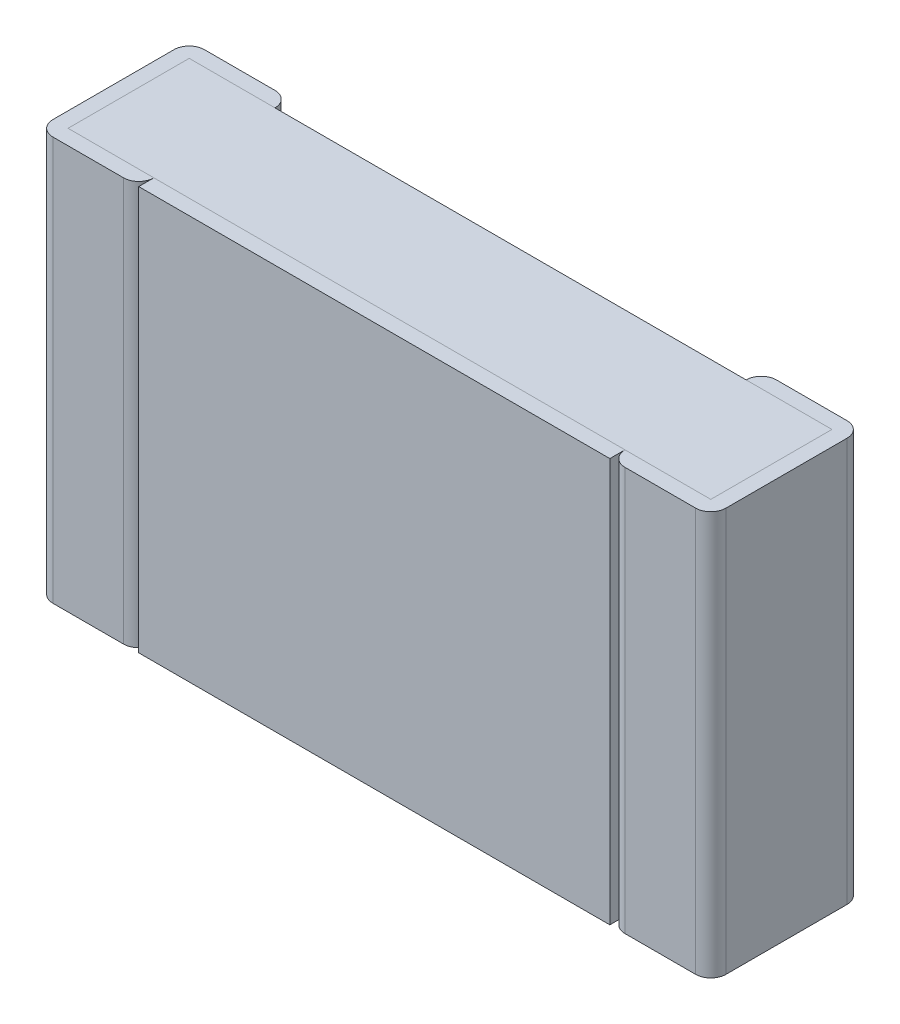
ISO-10303-21;
HEADER;
FILE_DESCRIPTION(('STEP AP214'),'2;1');
FILE_NAME('part.step','',(''),(''),'','','');
FILE_SCHEMA(('AUTOMOTIVE_DESIGN { 1 0 10303 214 1 1 1 1 }'));
ENDSEC;
DATA;
#1=APPLICATION_CONTEXT('core data for automotive mechanical design processes');
#2=APPLICATION_PROTOCOL_DEFINITION('international standard','automotive_design',2000,#1);
#3=PRODUCT_CONTEXT('',#1,'mechanical');
#4=PRODUCT('Part','Part','',(#3));
#5=PRODUCT_RELATED_PRODUCT_CATEGORY('part','',(#4));
#6=PRODUCT_DEFINITION_FORMATION('','',#4);
#7=PRODUCT_DEFINITION_CONTEXT('part definition',#1,'design');
#8=PRODUCT_DEFINITION('design','',#6,#7);
#9=PRODUCT_DEFINITION_SHAPE('','',#8);
#10=(LENGTH_UNIT() NAMED_UNIT(*) SI_UNIT(.MILLI.,.METRE.));
#11=(NAMED_UNIT(*) PLANE_ANGLE_UNIT() SI_UNIT($,.RADIAN.));
#12=(NAMED_UNIT(*) SI_UNIT($,.STERADIAN.) SOLID_ANGLE_UNIT());
#13=UNCERTAINTY_MEASURE_WITH_UNIT(LENGTH_MEASURE(1.E-05),#10,'distance_accuracy_value','');
#14=(GEOMETRIC_REPRESENTATION_CONTEXT(3) GLOBAL_UNCERTAINTY_ASSIGNED_CONTEXT((#13)) GLOBAL_UNIT_ASSIGNED_CONTEXT((#10,
#11,#12)) REPRESENTATION_CONTEXT('',''));
#15=CARTESIAN_POINT('',(0.,0.,0.));
#16=DIRECTION('',(0.,0.,1.));
#17=DIRECTION('',(1.,0.,0.));
#18=AXIS2_PLACEMENT_3D('',#15,#16,#17);
#19=CARTESIAN_POINT('',(-0.7,-0.6,0.45));
#20=DIRECTION('',(0.,0.,1.));
#21=DIRECTION('',(1.,0.,0.));
#22=AXIS2_PLACEMENT_3D('',#19,#20,#21);
#23=PLANE('',#22);
#24=DIRECTION('',(0.,1.,0.));
#25=VECTOR('',#24,1.);
#26=CARTESIAN_POINT('',(-0.7,-0.6,0.45));
#27=LINE('',#26,#25);
#28=CARTESIAN_POINT('',(-0.7,-0.6,0.45));
#29=VERTEX_POINT('',#28);
#30=CARTESIAN_POINT('',(-0.7,0.6,0.45));
#31=VERTEX_POINT('',#30);
#32=EDGE_CURVE('E306',#29,#31,#27,.T.);
#33=ORIENTED_EDGE('',*,*,#32,.F.);
#34=DIRECTION('',(1.,0.,0.));
#35=VECTOR('',#34,1.);
#36=CARTESIAN_POINT('',(-0.7,-0.6,0.45));
#37=LINE('',#36,#35);
#38=CARTESIAN_POINT('',(0.7,-0.6,0.45));
#39=VERTEX_POINT('',#38);
#40=EDGE_CURVE('E301',#29,#39,#37,.T.);
#41=ORIENTED_EDGE('',*,*,#40,.T.);
#42=DIRECTION('',(0.,1.,0.));
#43=VECTOR('',#42,1.);
#44=CARTESIAN_POINT('',(0.7,-0.6,0.45));
#45=LINE('',#44,#43);
#46=CARTESIAN_POINT('',(0.7,0.6,0.45));
#47=VERTEX_POINT('',#46);
#48=EDGE_CURVE('E11',#39,#47,#45,.T.);
#49=ORIENTED_EDGE('',*,*,#48,.T.);
#50=DIRECTION('',(1.,0.,0.));
#51=VECTOR('',#50,1.);
#52=CARTESIAN_POINT('',(-0.7,0.6,0.45));
#53=LINE('',#52,#51);
#54=EDGE_CURVE('E231',#31,#47,#53,.T.);
#55=ORIENTED_EDGE('',*,*,#54,.F.);
#56=EDGE_LOOP('',(#33,#41,#49,#55));
#57=FACE_BOUND('',#56,.T.);
#58=ADVANCED_FACE('F17',(#57),#23,.T.);
#59=CARTESIAN_POINT('',(0.7,-0.6,0.405));
#60=DIRECTION('',(1.,0.,0.));
#61=DIRECTION('',(0.,1.,0.));
#62=AXIS2_PLACEMENT_3D('',#59,#60,#61);
#63=PLANE('',#62);
#64=DIRECTION('',(0.,0.,1.));
#65=VECTOR('',#64,1.);
#66=CARTESIAN_POINT('',(0.7,-0.6,0.405));
#67=LINE('',#66,#65);
#68=CARTESIAN_POINT('',(0.7,-0.6,0.405));
#69=VERTEX_POINT('',#68);
#70=EDGE_CURVE('E297',#69,#39,#67,.T.);
#71=ORIENTED_EDGE('',*,*,#70,.F.);
#72=DIRECTION('',(0.,1.,0.));
#73=VECTOR('',#72,1.);
#74=CARTESIAN_POINT('',(0.7,-0.6,0.405));
#75=LINE('',#74,#73);
#76=CARTESIAN_POINT('',(0.7,0.6,0.405));
#77=VERTEX_POINT('',#76);
#78=EDGE_CURVE('E25',#69,#77,#75,.T.);
#79=ORIENTED_EDGE('',*,*,#78,.T.);
#80=DIRECTION('',(0.,0.,1.));
#81=VECTOR('',#80,1.);
#82=CARTESIAN_POINT('',(0.7,0.6,0.405));
#83=LINE('',#82,#81);
#84=EDGE_CURVE('E232',#77,#47,#83,.T.);
#85=ORIENTED_EDGE('',*,*,#84,.T.);
#86=ORIENTED_EDGE('',*,*,#48,.F.);
#87=EDGE_LOOP('',(#71,#79,#85,#86));
#88=FACE_BOUND('',#87,.T.);
#89=ADVANCED_FACE('F428',(#88),#63,.T.);
#90=CARTESIAN_POINT('',(0.745,-0.6,0.405));
#91=DIRECTION('',(0.,1.,0.));
#92=DIRECTION('',(-1.,0.,0.));
#93=AXIS2_PLACEMENT_3D('',#90,#91,#92);
#94=CYLINDRICAL_SURFACE('',#93,0.045);
#95=CARTESIAN_POINT('',(0.745,-0.6,0.405));
#96=DIRECTION('',(0.,1.,0.));
#97=DIRECTION('',(0.,0.,1.));
#98=AXIS2_PLACEMENT_3D('',#95,#96,#97);
#99=CIRCLE('',#98,0.045);
#100=CARTESIAN_POINT('',(0.745,-0.6,0.45));
#101=VERTEX_POINT('',#100);
#102=EDGE_CURVE('E296',#69,#101,#99,.T.);
#103=ORIENTED_EDGE('',*,*,#102,.T.);
#104=DIRECTION('',(0.,1.,0.));
#105=VECTOR('',#104,1.);
#106=CARTESIAN_POINT('',(0.745,-0.6,0.45));
#107=LINE('',#106,#105);
#108=CARTESIAN_POINT('',(0.745,0.6,0.45));
#109=VERTEX_POINT('',#108);
#110=EDGE_CURVE('E203',#101,#109,#107,.T.);
#111=ORIENTED_EDGE('',*,*,#110,.T.);
#112=CARTESIAN_POINT('',(0.745,0.6,0.405));
#113=DIRECTION('',(0.,1.,0.));
#114=DIRECTION('',(0.,0.,1.));
#115=AXIS2_PLACEMENT_3D('',#112,#113,#114);
#116=CIRCLE('',#115,0.045);
#117=EDGE_CURVE('E218',#77,#109,#116,.T.);
#118=ORIENTED_EDGE('',*,*,#117,.F.);
#119=ORIENTED_EDGE('',*,*,#78,.F.);
#120=EDGE_LOOP('',(#103,#111,#118,#119));
#121=FACE_BOUND('',#120,.T.);
#122=ADVANCED_FACE('F432',(#121),#94,.T.);
#123=CARTESIAN_POINT('',(0.7,-0.6,0.45));
#124=DIRECTION('',(0.,0.,1.));
#125=DIRECTION('',(1.,0.,0.));
#126=AXIS2_PLACEMENT_3D('',#123,#124,#125);
#127=PLANE('',#126);
#128=DIRECTION('',(1.,0.,0.));
#129=VECTOR('',#128,1.);
#130=CARTESIAN_POINT('',(0.7,0.6,0.45));
#131=LINE('',#130,#129);
#132=CARTESIAN_POINT('',(0.955,0.6,0.45));
#133=VERTEX_POINT('',#132);
#134=EDGE_CURVE('E195',#109,#133,#131,.T.);
#135=ORIENTED_EDGE('',*,*,#134,.F.);
#136=ORIENTED_EDGE('',*,*,#110,.F.);
#137=DIRECTION('',(1.,0.,0.));
#138=VECTOR('',#137,1.);
#139=CARTESIAN_POINT('',(0.7,-0.6,0.45));
#140=LINE('',#139,#138);
#141=CARTESIAN_POINT('',(0.955,-0.6,0.45));
#142=VERTEX_POINT('',#141);
#143=EDGE_CURVE('E198',#101,#142,#140,.T.);
#144=ORIENTED_EDGE('',*,*,#143,.T.);
#145=DIRECTION('',(0.,1.,0.));
#146=VECTOR('',#145,1.);
#147=CARTESIAN_POINT('',(0.955,-0.6,0.45));
#148=LINE('',#147,#146);
#149=EDGE_CURVE('E191',#142,#133,#148,.T.);
#150=ORIENTED_EDGE('',*,*,#149,.T.);
#151=EDGE_LOOP('',(#135,#136,#144,#150));
#152=FACE_BOUND('',#151,.T.);
#153=ADVANCED_FACE('F193',(#152),#127,.T.);
#154=CARTESIAN_POINT('',(0.955,-0.6,0.405));
#155=DIRECTION('',(0.,1.,0.));
#156=DIRECTION('',(1.,0.,0.));
#157=AXIS2_PLACEMENT_3D('',#154,#155,#156);
#158=CYLINDRICAL_SURFACE('',#157,0.045);
#159=DIRECTION('',(0.,1.,0.));
#160=VECTOR('',#159,1.);
#161=CARTESIAN_POINT('',(1.,-0.6,0.405));
#162=LINE('',#161,#160);
#163=CARTESIAN_POINT('',(1.,-0.6,0.405));
#164=VERTEX_POINT('',#163);
#165=CARTESIAN_POINT('',(1.,0.6,0.405));
#166=VERTEX_POINT('',#165);
#167=EDGE_CURVE('E204',#164,#166,#162,.T.);
#168=ORIENTED_EDGE('',*,*,#167,.T.);
#169=CARTESIAN_POINT('',(0.955,0.6,0.405));
#170=DIRECTION('',(0.,-1.,0.));
#171=DIRECTION('',(0.,0.,1.));
#172=AXIS2_PLACEMENT_3D('',#169,#170,#171);
#173=CIRCLE('',#172,0.045);
#174=EDGE_CURVE('E207',#166,#133,#173,.T.);
#175=ORIENTED_EDGE('',*,*,#174,.T.);
#176=ORIENTED_EDGE('',*,*,#149,.F.);
#177=CARTESIAN_POINT('',(0.955,-0.6,0.405));
#178=DIRECTION('',(0.,-1.,0.));
#179=DIRECTION('',(0.,0.,1.));
#180=AXIS2_PLACEMENT_3D('',#177,#178,#179);
#181=CIRCLE('',#180,0.045);
#182=EDGE_CURVE('E289',#164,#142,#181,.T.);
#183=ORIENTED_EDGE('',*,*,#182,.F.);
#184=EDGE_LOOP('',(#168,#175,#176,#183));
#185=FACE_BOUND('',#184,.T.);
#186=ADVANCED_FACE('F208',(#185),#158,.T.);
#187=CARTESIAN_POINT('',(1.,-0.6,0.));
#188=DIRECTION('',(1.,0.,0.));
#189=DIRECTION('',(0.,1.,0.));
#190=AXIS2_PLACEMENT_3D('',#187,#188,#189);
#191=PLANE('',#190);
#192=DIRECTION('',(0.,0.,1.));
#193=VECTOR('',#192,1.);
#194=CARTESIAN_POINT('',(1.,-0.6,0.));
#195=LINE('',#194,#193);
#196=CARTESIAN_POINT('',(1.,-0.6,0.045));
#197=VERTEX_POINT('',#196);
#198=EDGE_CURVE('E286',#197,#164,#195,.T.);
#199=ORIENTED_EDGE('',*,*,#198,.F.);
#200=DIRECTION('',(0.,1.,0.));
#201=VECTOR('',#200,1.);
#202=CARTESIAN_POINT('',(1.,-0.6,0.045));
#203=LINE('',#202,#201);
#204=CARTESIAN_POINT('',(1.,0.6,0.045));
#205=VERTEX_POINT('',#204);
#206=EDGE_CURVE('E48',#197,#205,#203,.T.);
#207=ORIENTED_EDGE('',*,*,#206,.T.);
#208=DIRECTION('',(0.,0.,1.));
#209=VECTOR('',#208,1.);
#210=CARTESIAN_POINT('',(1.,0.6,0.));
#211=LINE('',#210,#209);
#212=EDGE_CURVE('E212',#205,#166,#211,.T.);
#213=ORIENTED_EDGE('',*,*,#212,.T.);
#214=ORIENTED_EDGE('',*,*,#167,.F.);
#215=EDGE_LOOP('',(#199,#207,#213,#214));
#216=FACE_BOUND('',#215,.T.);
#217=ADVANCED_FACE('F467',(#216),#191,.T.);
#218=CARTESIAN_POINT('',(0.955,-0.6,0.045));
#219=DIRECTION('',(0.,1.,0.));
#220=DIRECTION('',(1.,0.,0.));
#221=AXIS2_PLACEMENT_3D('',#218,#219,#220);
#222=CYLINDRICAL_SURFACE('',#221,0.045);
#223=CARTESIAN_POINT('',(0.955,-0.6,0.045));
#224=DIRECTION('',(0.,1.,0.));
#225=DIRECTION('',(0.,0.,1.));
#226=AXIS2_PLACEMENT_3D('',#223,#224,#225);
#227=CIRCLE('',#226,0.045);
#228=CARTESIAN_POINT('',(0.955,-0.6,0.));
#229=VERTEX_POINT('',#228);
#230=EDGE_CURVE('E282',#197,#229,#227,.T.);
#231=ORIENTED_EDGE('',*,*,#230,.T.);
#232=DIRECTION('',(0.,1.,0.));
#233=VECTOR('',#232,1.);
#234=CARTESIAN_POINT('',(0.955,-0.6,0.));
#235=LINE('',#234,#233);
#236=CARTESIAN_POINT('',(0.955,0.6,0.));
#237=VERTEX_POINT('',#236);
#238=EDGE_CURVE('E238',#229,#237,#235,.T.);
#239=ORIENTED_EDGE('',*,*,#238,.T.);
#240=CARTESIAN_POINT('',(0.955,0.6,0.045));
#241=DIRECTION('',(0.,1.,0.));
#242=DIRECTION('',(0.,0.,1.));
#243=AXIS2_PLACEMENT_3D('',#240,#241,#242);
#244=CIRCLE('',#243,0.045);
#245=EDGE_CURVE('E227',#205,#237,#244,.T.);
#246=ORIENTED_EDGE('',*,*,#245,.F.);
#247=ORIENTED_EDGE('',*,*,#206,.F.);
#248=EDGE_LOOP('',(#231,#239,#246,#247));
#249=FACE_BOUND('',#248,.T.);
#250=ADVANCED_FACE('F469',(#249),#222,.T.);
#251=CARTESIAN_POINT('',(0.7,-0.6,0.));
#252=DIRECTION('',(0.,0.,1.));
#253=DIRECTION('',(1.,0.,0.));
#254=AXIS2_PLACEMENT_3D('',#251,#252,#253);
#255=PLANE('',#254);
#256=ORIENTED_EDGE('',*,*,#238,.F.);
#257=DIRECTION('',(1.,0.,0.));
#258=VECTOR('',#257,1.);
#259=CARTESIAN_POINT('',(0.7,-0.6,0.));
#260=LINE('',#259,#258);
#261=CARTESIAN_POINT('',(0.745,-0.6,0.));
#262=VERTEX_POINT('',#261);
#263=EDGE_CURVE('E295',#262,#229,#260,.T.);
#264=ORIENTED_EDGE('',*,*,#263,.F.);
#265=DIRECTION('',(0.,1.,0.));
#266=VECTOR('',#265,1.);
#267=CARTESIAN_POINT('',(0.745,-0.6,0.));
#268=LINE('',#267,#266);
#269=CARTESIAN_POINT('',(0.745,0.6,0.));
#270=VERTEX_POINT('',#269);
#271=EDGE_CURVE('E235',#262,#270,#268,.T.);
#272=ORIENTED_EDGE('',*,*,#271,.T.);
#273=DIRECTION('',(1.,0.,0.));
#274=VECTOR('',#273,1.);
#275=CARTESIAN_POINT('',(0.7,0.6,0.));
#276=LINE('',#275,#274);
#277=EDGE_CURVE('E313',#270,#237,#276,.T.);
#278=ORIENTED_EDGE('',*,*,#277,.T.);
#279=EDGE_LOOP('',(#256,#264,#272,#278));
#280=FACE_BOUND('',#279,.T.);
#281=ADVANCED_FACE('F471',(#280),#255,.F.);
#282=CARTESIAN_POINT('',(0.745,-0.6,0.045));
#283=DIRECTION('',(0.,1.,0.));
#284=DIRECTION('',(-1.,0.,0.));
#285=AXIS2_PLACEMENT_3D('',#282,#283,#284);
#286=CYLINDRICAL_SURFACE('',#285,0.045);
#287=DIRECTION('',(0.,1.,0.));
#288=VECTOR('',#287,1.);
#289=CARTESIAN_POINT('',(0.7,-0.6,0.045));
#290=LINE('',#289,#288);
#291=CARTESIAN_POINT('',(0.7,-0.6,0.045));
#292=VERTEX_POINT('',#291);
#293=CARTESIAN_POINT('',(0.7,0.6,0.045));
#294=VERTEX_POINT('',#293);
#295=EDGE_CURVE('E278',#292,#294,#290,.T.);
#296=ORIENTED_EDGE('',*,*,#295,.T.);
#297=CARTESIAN_POINT('',(0.745,0.6,0.045));
#298=DIRECTION('',(0.,-1.,0.));
#299=DIRECTION('',(0.,0.,1.));
#300=AXIS2_PLACEMENT_3D('',#297,#298,#299);
#301=CIRCLE('',#300,0.045);
#302=EDGE_CURVE('E223',#294,#270,#301,.T.);
#303=ORIENTED_EDGE('',*,*,#302,.T.);
#304=ORIENTED_EDGE('',*,*,#271,.F.);
#305=CARTESIAN_POINT('',(0.745,-0.6,0.045));
#306=DIRECTION('',(0.,-1.,0.));
#307=DIRECTION('',(0.,0.,1.));
#308=AXIS2_PLACEMENT_3D('',#305,#306,#307);
#309=CIRCLE('',#308,0.045);
#310=EDGE_CURVE('E291',#292,#262,#309,.T.);
#311=ORIENTED_EDGE('',*,*,#310,.F.);
#312=EDGE_LOOP('',(#296,#303,#304,#311));
#313=FACE_BOUND('',#312,.T.);
#314=ADVANCED_FACE('F563',(#313),#286,.T.);
#315=CARTESIAN_POINT('',(-0.7,0.6,0.405));
#316=DIRECTION('',(0.,1.,0.));
#317=DIRECTION('',(1.,0.,0.));
#318=AXIS2_PLACEMENT_3D('',#315,#316,#317);
#319=PLANE('',#318);
#320=DIRECTION('',(1.,0.,0.));
#321=VECTOR('',#320,1.);
#322=CARTESIAN_POINT('',(-0.7,0.6,0.405));
#323=LINE('',#322,#321);
#324=CARTESIAN_POINT('',(-0.7,0.6,0.405));
#325=VERTEX_POINT('',#324);
#326=EDGE_CURVE('E263',#325,#77,#323,.T.);
#327=ORIENTED_EDGE('',*,*,#326,.F.);
#328=DIRECTION('',(0.,0.,1.));
#329=VECTOR('',#328,1.);
#330=CARTESIAN_POINT('',(-0.7,0.6,0.405));
#331=LINE('',#330,#329);
#332=EDGE_CURVE('E310',#325,#31,#331,.T.);
#333=ORIENTED_EDGE('',*,*,#332,.T.);
#334=ORIENTED_EDGE('',*,*,#54,.T.);
#335=ORIENTED_EDGE('',*,*,#84,.F.);
#336=EDGE_LOOP('',(#327,#333,#334,#335));
#337=FACE_BOUND('',#336,.T.);
#338=ADVANCED_FACE('F417',(#337),#319,.T.);
#339=CARTESIAN_POINT('',(0.7,0.6,0.));
#340=DIRECTION('',(0.,1.,0.));
#341=DIRECTION('',(1.,0.,0.));
#342=AXIS2_PLACEMENT_3D('',#339,#340,#341);
#343=PLANE('',#342);
#344=ORIENTED_EDGE('',*,*,#277,.F.);
#345=ORIENTED_EDGE('',*,*,#302,.F.);
#346=DIRECTION('',(1.,0.,0.));
#347=VECTOR('',#346,1.);
#348=CARTESIAN_POINT('',(-0.955,0.6,0.045));
#349=LINE('',#348,#347);
#350=CARTESIAN_POINT('',(0.955,0.6,0.045));
#351=VERTEX_POINT('',#350);
#352=EDGE_CURVE('E274',#294,#351,#349,.T.);
#353=ORIENTED_EDGE('',*,*,#352,.T.);
#354=DIRECTION('',(0.,0.,1.));
#355=VECTOR('',#354,1.);
#356=CARTESIAN_POINT('',(0.955,0.6,0.045));
#357=LINE('',#356,#355);
#358=CARTESIAN_POINT('',(0.955,0.6,0.405));
#359=VERTEX_POINT('',#358);
#360=EDGE_CURVE('E271',#351,#359,#357,.T.);
#361=ORIENTED_EDGE('',*,*,#360,.T.);
#362=DIRECTION('',(1.,0.,0.));
#363=VECTOR('',#362,1.);
#364=CARTESIAN_POINT('',(-0.955,0.6,0.405));
#365=LINE('',#364,#363);
#366=EDGE_CURVE('E267',#77,#359,#365,.T.);
#367=ORIENTED_EDGE('',*,*,#366,.F.);
#368=ORIENTED_EDGE('',*,*,#117,.T.);
#369=ORIENTED_EDGE('',*,*,#134,.T.);
#370=ORIENTED_EDGE('',*,*,#174,.F.);
#371=ORIENTED_EDGE('',*,*,#212,.F.);
#372=ORIENTED_EDGE('',*,*,#245,.T.);
#373=EDGE_LOOP('',(#344,#345,#353,#361,#367,#368,#369,#370,#371,#372));
#374=FACE_BOUND('',#373,.T.);
#375=ADVANCED_FACE('F215',(#374),#343,.T.);
#376=CARTESIAN_POINT('',(-0.7,-0.6,0.405));
#377=DIRECTION('',(1.,0.,0.));
#378=DIRECTION('',(0.,1.,0.));
#379=AXIS2_PLACEMENT_3D('',#376,#377,#378);
#380=PLANE('',#379);
#381=ORIENTED_EDGE('',*,*,#32,.T.);
#382=ORIENTED_EDGE('',*,*,#332,.F.);
#383=DIRECTION('',(0.,1.,0.));
#384=VECTOR('',#383,1.);
#385=CARTESIAN_POINT('',(-0.7,-0.6,0.405));
#386=LINE('',#385,#384);
#387=CARTESIAN_POINT('',(-0.7,-0.6,0.405));
#388=VERTEX_POINT('',#387);
#389=EDGE_CURVE('E260',#388,#325,#386,.T.);
#390=ORIENTED_EDGE('',*,*,#389,.F.);
#391=DIRECTION('',(0.,0.,1.));
#392=VECTOR('',#391,1.);
#393=CARTESIAN_POINT('',(-0.7,-0.6,0.405));
#394=LINE('',#393,#392);
#395=EDGE_CURVE('E302',#388,#29,#394,.T.);
#396=ORIENTED_EDGE('',*,*,#395,.T.);
#397=EDGE_LOOP('',(#381,#382,#390,#396));
#398=FACE_BOUND('',#397,.T.);
#399=ADVANCED_FACE('F421',(#398),#380,.F.);
#400=CARTESIAN_POINT('',(-0.7,-0.6,0.405));
#401=DIRECTION('',(0.,1.,0.));
#402=DIRECTION('',(1.,0.,0.));
#403=AXIS2_PLACEMENT_3D('',#400,#401,#402);
#404=PLANE('',#403);
#405=ORIENTED_EDGE('',*,*,#70,.T.);
#406=ORIENTED_EDGE('',*,*,#40,.F.);
#407=ORIENTED_EDGE('',*,*,#395,.F.);
#408=DIRECTION('',(1.,0.,0.));
#409=VECTOR('',#408,1.);
#410=CARTESIAN_POINT('',(-0.7,-0.6,0.405));
#411=LINE('',#410,#409);
#412=EDGE_CURVE('E404',#388,#69,#411,.T.);
#413=ORIENTED_EDGE('',*,*,#412,.T.);
#414=EDGE_LOOP('',(#405,#406,#407,#413));
#415=FACE_BOUND('',#414,.T.);
#416=ADVANCED_FACE('F424',(#415),#404,.F.);
#417=CARTESIAN_POINT('',(0.7,-0.6,0.));
#418=DIRECTION('',(0.,1.,0.));
#419=DIRECTION('',(1.,0.,0.));
#420=AXIS2_PLACEMENT_3D('',#417,#418,#419);
#421=PLANE('',#420);
#422=ORIENTED_EDGE('',*,*,#230,.F.);
#423=ORIENTED_EDGE('',*,*,#198,.T.);
#424=ORIENTED_EDGE('',*,*,#182,.T.);
#425=ORIENTED_EDGE('',*,*,#143,.F.);
#426=ORIENTED_EDGE('',*,*,#102,.F.);
#427=DIRECTION('',(1.,0.,0.));
#428=VECTOR('',#427,1.);
#429=CARTESIAN_POINT('',(-0.955,-0.6,0.405));
#430=LINE('',#429,#428);
#431=CARTESIAN_POINT('',(0.955,-0.6,0.405));
#432=VERTEX_POINT('',#431);
#433=EDGE_CURVE('E401',#69,#432,#430,.T.);
#434=ORIENTED_EDGE('',*,*,#433,.T.);
#435=DIRECTION('',(0.,0.,1.));
#436=VECTOR('',#435,1.);
#437=CARTESIAN_POINT('',(0.955,-0.6,0.045));
#438=LINE('',#437,#436);
#439=CARTESIAN_POINT('',(0.955,-0.6,0.045));
#440=VERTEX_POINT('',#439);
#441=EDGE_CURVE('E400',#440,#432,#438,.T.);
#442=ORIENTED_EDGE('',*,*,#441,.F.);
#443=DIRECTION('',(1.,0.,0.));
#444=VECTOR('',#443,1.);
#445=CARTESIAN_POINT('',(-0.955,-0.6,0.045));
#446=LINE('',#445,#444);
#447=EDGE_CURVE('E396',#292,#440,#446,.T.);
#448=ORIENTED_EDGE('',*,*,#447,.F.);
#449=ORIENTED_EDGE('',*,*,#310,.T.);
#450=ORIENTED_EDGE('',*,*,#263,.T.);
#451=EDGE_LOOP('',(#422,#423,#424,#425,#426,#434,#442,#448,#449,#450));
#452=FACE_BOUND('',#451,.T.);
#453=ADVANCED_FACE('F431',(#452),#421,.F.);
#454=CARTESIAN_POINT('',(-0.955,-0.6,0.045));
#455=DIRECTION('',(0.,0.,1.));
#456=DIRECTION('',(1.,0.,0.));
#457=AXIS2_PLACEMENT_3D('',#454,#455,#456);
#458=PLANE('',#457);
#459=DIRECTION('',(1.,0.,0.));
#460=VECTOR('',#459,1.);
#461=CARTESIAN_POINT('',(-0.955,0.6,0.045));
#462=LINE('',#461,#460);
#463=CARTESIAN_POINT('',(-0.7,0.6,0.045));
#464=VERTEX_POINT('',#463);
#465=EDGE_CURVE('E277',#464,#294,#462,.T.);
#466=ORIENTED_EDGE('',*,*,#465,.T.);
#467=ORIENTED_EDGE('',*,*,#295,.F.);
#468=DIRECTION('',(1.,0.,0.));
#469=VECTOR('',#468,1.);
#470=CARTESIAN_POINT('',(-0.955,-0.6,0.045));
#471=LINE('',#470,#469);
#472=CARTESIAN_POINT('',(-0.7,-0.6,0.045));
#473=VERTEX_POINT('',#472);
#474=EDGE_CURVE('E392',#473,#292,#471,.T.);
#475=ORIENTED_EDGE('',*,*,#474,.F.);
#476=DIRECTION('',(0.,1.,0.));
#477=VECTOR('',#476,1.);
#478=CARTESIAN_POINT('',(-0.7,-0.6,0.045));
#479=LINE('',#478,#477);
#480=EDGE_CURVE('E388',#473,#464,#479,.T.);
#481=ORIENTED_EDGE('',*,*,#480,.T.);
#482=EDGE_LOOP('',(#466,#467,#475,#481));
#483=FACE_BOUND('',#482,.T.);
#484=ADVANCED_FACE('F561',(#483),#458,.F.);
#485=CARTESIAN_POINT('',(-0.955,0.6,0.045));
#486=DIRECTION('',(0.,1.,0.));
#487=DIRECTION('',(1.,0.,0.));
#488=AXIS2_PLACEMENT_3D('',#485,#486,#487);
#489=PLANE('',#488);
#490=DIRECTION('',(1.,0.,0.));
#491=VECTOR('',#490,1.);
#492=CARTESIAN_POINT('',(-0.955,0.6,0.045));
#493=LINE('',#492,#491);
#494=CARTESIAN_POINT('',(-0.955,0.6,0.045));
#495=VERTEX_POINT('',#494);
#496=EDGE_CURVE('E353',#495,#464,#493,.T.);
#497=ORIENTED_EDGE('',*,*,#496,.F.);
#498=DIRECTION('',(0.,0.,1.));
#499=VECTOR('',#498,1.);
#500=CARTESIAN_POINT('',(-0.955,0.6,0.045));
#501=LINE('',#500,#499);
#502=CARTESIAN_POINT('',(-0.955,0.6,0.405));
#503=VERTEX_POINT('',#502);
#504=EDGE_CURVE('E358',#495,#503,#501,.T.);
#505=ORIENTED_EDGE('',*,*,#504,.T.);
#506=DIRECTION('',(1.,0.,0.));
#507=VECTOR('',#506,1.);
#508=CARTESIAN_POINT('',(-0.955,0.6,0.405));
#509=LINE('',#508,#507);
#510=EDGE_CURVE('E374',#503,#325,#509,.T.);
#511=ORIENTED_EDGE('',*,*,#510,.T.);
#512=ORIENTED_EDGE('',*,*,#326,.T.);
#513=ORIENTED_EDGE('',*,*,#366,.T.);
#514=ORIENTED_EDGE('',*,*,#360,.F.);
#515=ORIENTED_EDGE('',*,*,#352,.F.);
#516=ORIENTED_EDGE('',*,*,#465,.F.);
#517=EDGE_LOOP('',(#497,#505,#511,#512,#513,#514,#515,#516));
#518=FACE_BOUND('',#517,.T.);
#519=ADVANCED_FACE('F435',(#518),#489,.T.);
#520=CARTESIAN_POINT('',(-0.745,-0.6,0.405));
#521=DIRECTION('',(0.,1.,0.));
#522=DIRECTION('',(1.,0.,0.));
#523=AXIS2_PLACEMENT_3D('',#520,#521,#522);
#524=CYLINDRICAL_SURFACE('',#523,0.045);
#525=ORIENTED_EDGE('',*,*,#389,.T.);
#526=CARTESIAN_POINT('',(-0.745,0.6,0.405));
#527=DIRECTION('',(0.,-1.,0.));
#528=DIRECTION('',(0.,0.,1.));
#529=AXIS2_PLACEMENT_3D('',#526,#527,#528);
#530=CIRCLE('',#529,0.045);
#531=CARTESIAN_POINT('',(-0.745,0.6,0.45));
#532=VERTEX_POINT('',#531);
#533=EDGE_CURVE('E366',#325,#532,#530,.T.);
#534=ORIENTED_EDGE('',*,*,#533,.T.);
#535=DIRECTION('',(0.,1.,0.));
#536=VECTOR('',#535,1.);
#537=CARTESIAN_POINT('',(-0.745,-0.6,0.45));
#538=LINE('',#537,#536);
#539=CARTESIAN_POINT('',(-0.745,-0.6,0.45));
#540=VERTEX_POINT('',#539);
#541=EDGE_CURVE('E258',#540,#532,#538,.T.);
#542=ORIENTED_EDGE('',*,*,#541,.F.);
#543=CARTESIAN_POINT('',(-0.745,-0.6,0.405));
#544=DIRECTION('',(0.,-1.,0.));
#545=DIRECTION('',(0.,0.,1.));
#546=AXIS2_PLACEMENT_3D('',#543,#544,#545);
#547=CIRCLE('',#546,0.045);
#548=EDGE_CURVE('E442',#388,#540,#547,.T.);
#549=ORIENTED_EDGE('',*,*,#548,.F.);
#550=EDGE_LOOP('',(#525,#534,#542,#549));
#551=FACE_BOUND('',#550,.T.);
#552=ADVANCED_FACE('F440',(#551),#524,.T.);
#553=CARTESIAN_POINT('',(-1.,-0.6,0.45));
#554=DIRECTION('',(0.,0.,1.));
#555=DIRECTION('',(1.,0.,0.));
#556=AXIS2_PLACEMENT_3D('',#553,#554,#555);
#557=PLANE('',#556);
#558=DIRECTION('',(1.,0.,0.));
#559=VECTOR('',#558,1.);
#560=CARTESIAN_POINT('',(-1.,0.6,0.45));
#561=LINE('',#560,#559);
#562=CARTESIAN_POINT('',(-0.955,0.6,0.45));
#563=VERTEX_POINT('',#562);
#564=EDGE_CURVE('E362',#563,#532,#561,.T.);
#565=ORIENTED_EDGE('',*,*,#564,.F.);
#566=DIRECTION('',(0.,1.,0.));
#567=VECTOR('',#566,1.);
#568=CARTESIAN_POINT('',(-0.955,-0.6,0.45));
#569=LINE('',#568,#567);
#570=CARTESIAN_POINT('',(-0.955,-0.6,0.45));
#571=VERTEX_POINT('',#570);
#572=EDGE_CURVE('E344',#571,#563,#569,.T.);
#573=ORIENTED_EDGE('',*,*,#572,.F.);
#574=DIRECTION('',(1.,0.,0.));
#575=VECTOR('',#574,1.);
#576=CARTESIAN_POINT('',(-1.,-0.6,0.45));
#577=LINE('',#576,#575);
#578=EDGE_CURVE('E448',#571,#540,#577,.T.);
#579=ORIENTED_EDGE('',*,*,#578,.T.);
#580=ORIENTED_EDGE('',*,*,#541,.T.);
#581=EDGE_LOOP('',(#565,#573,#579,#580));
#582=FACE_BOUND('',#581,.T.);
#583=ADVANCED_FACE('F689',(#582),#557,.T.);
#584=CARTESIAN_POINT('',(-0.955,-0.6,0.045));
#585=DIRECTION('',(0.,1.,0.));
#586=DIRECTION('',(1.,0.,0.));
#587=AXIS2_PLACEMENT_3D('',#584,#585,#586);
#588=PLANE('',#587);
#589=ORIENTED_EDGE('',*,*,#474,.T.);
#590=ORIENTED_EDGE('',*,*,#447,.T.);
#591=ORIENTED_EDGE('',*,*,#441,.T.);
#592=ORIENTED_EDGE('',*,*,#433,.F.);
#593=ORIENTED_EDGE('',*,*,#412,.F.);
#594=DIRECTION('',(1.,0.,0.));
#595=VECTOR('',#594,1.);
#596=CARTESIAN_POINT('',(-0.955,-0.6,0.405));
#597=LINE('',#596,#595);
#598=CARTESIAN_POINT('',(-0.955,-0.6,0.405));
#599=VERTEX_POINT('',#598);
#600=EDGE_CURVE('E449',#599,#388,#597,.T.);
#601=ORIENTED_EDGE('',*,*,#600,.F.);
#602=DIRECTION('',(0.,0.,1.));
#603=VECTOR('',#602,1.);
#604=CARTESIAN_POINT('',(-0.955,-0.6,0.045));
#605=LINE('',#604,#603);
#606=CARTESIAN_POINT('',(-0.955,-0.6,0.045));
#607=VERTEX_POINT('',#606);
#608=EDGE_CURVE('E454',#607,#599,#605,.T.);
#609=ORIENTED_EDGE('',*,*,#608,.F.);
#610=DIRECTION('',(1.,0.,0.));
#611=VECTOR('',#610,1.);
#612=CARTESIAN_POINT('',(-0.955,-0.6,0.045));
#613=LINE('',#612,#611);
#614=EDGE_CURVE('E461',#607,#473,#613,.T.);
#615=ORIENTED_EDGE('',*,*,#614,.T.);
#616=EDGE_LOOP('',(#589,#590,#591,#592,#593,#601,#609,#615));
#617=FACE_BOUND('',#616,.T.);
#618=ADVANCED_FACE('F557',(#617),#588,.F.);
#619=CARTESIAN_POINT('',(-0.745,-0.6,0.045));
#620=DIRECTION('',(0.,1.,0.));
#621=DIRECTION('',(1.,0.,0.));
#622=AXIS2_PLACEMENT_3D('',#619,#620,#621);
#623=CYLINDRICAL_SURFACE('',#622,0.045);
#624=CARTESIAN_POINT('',(-0.745,-0.6,0.045));
#625=DIRECTION('',(0.,1.,0.));
#626=DIRECTION('',(0.,0.,1.));
#627=AXIS2_PLACEMENT_3D('',#624,#625,#626);
#628=CIRCLE('',#627,0.045);
#629=CARTESIAN_POINT('',(-0.745,-0.6,0.));
#630=VERTEX_POINT('',#629);
#631=EDGE_CURVE('E509',#473,#630,#628,.T.);
#632=ORIENTED_EDGE('',*,*,#631,.T.);
#633=DIRECTION('',(0.,1.,0.));
#634=VECTOR('',#633,1.);
#635=CARTESIAN_POINT('',(-0.745,-0.6,0.));
#636=LINE('',#635,#634);
#637=CARTESIAN_POINT('',(-0.745,0.6,0.));
#638=VERTEX_POINT('',#637);
#639=EDGE_CURVE('E383',#630,#638,#636,.T.);
#640=ORIENTED_EDGE('',*,*,#639,.T.);
#641=CARTESIAN_POINT('',(-0.745,0.6,0.045));
#642=DIRECTION('',(0.,1.,0.));
#643=DIRECTION('',(0.,0.,1.));
#644=AXIS2_PLACEMENT_3D('',#641,#642,#643);
#645=CIRCLE('',#644,0.045);
#646=EDGE_CURVE('E357',#464,#638,#645,.T.);
#647=ORIENTED_EDGE('',*,*,#646,.F.);
#648=ORIENTED_EDGE('',*,*,#480,.F.);
#649=EDGE_LOOP('',(#632,#640,#647,#648));
#650=FACE_BOUND('',#649,.T.);
#651=ADVANCED_FACE('F554',(#650),#623,.T.);
#652=CARTESIAN_POINT('',(-1.,-0.6,0.));
#653=DIRECTION('',(0.,0.,1.));
#654=DIRECTION('',(1.,0.,0.));
#655=AXIS2_PLACEMENT_3D('',#652,#653,#654);
#656=PLANE('',#655);
#657=ORIENTED_EDGE('',*,*,#639,.F.);
#658=DIRECTION('',(1.,0.,0.));
#659=VECTOR('',#658,1.);
#660=CARTESIAN_POINT('',(-1.,-0.6,0.));
#661=LINE('',#660,#659);
#662=CARTESIAN_POINT('',(-0.955,-0.6,0.));
#663=VERTEX_POINT('',#662);
#664=EDGE_CURVE('E332',#663,#630,#661,.T.);
#665=ORIENTED_EDGE('',*,*,#664,.F.);
#666=DIRECTION('',(0.,1.,0.));
#667=VECTOR('',#666,1.);
#668=CARTESIAN_POINT('',(-0.955,-0.6,0.));
#669=LINE('',#668,#667);
#670=CARTESIAN_POINT('',(-0.955,0.6,0.));
#671=VERTEX_POINT('',#670);
#672=EDGE_CURVE('E340',#663,#671,#669,.T.);
#673=ORIENTED_EDGE('',*,*,#672,.T.);
#674=DIRECTION('',(1.,0.,0.));
#675=VECTOR('',#674,1.);
#676=CARTESIAN_POINT('',(-1.,0.6,0.));
#677=LINE('',#676,#675);
#678=EDGE_CURVE('E352',#671,#638,#677,.T.);
#679=ORIENTED_EDGE('',*,*,#678,.T.);
#680=EDGE_LOOP('',(#657,#665,#673,#679));
#681=FACE_BOUND('',#680,.T.);
#682=ADVANCED_FACE('F550',(#681),#656,.F.);
#683=CARTESIAN_POINT('',(-1.,0.6,0.));
#684=DIRECTION('',(0.,1.,0.));
#685=DIRECTION('',(1.,0.,0.));
#686=AXIS2_PLACEMENT_3D('',#683,#684,#685);
#687=PLANE('',#686);
#688=ORIENTED_EDGE('',*,*,#678,.F.);
#689=CARTESIAN_POINT('',(-0.955,0.6,0.045));
#690=DIRECTION('',(0.,-1.,0.));
#691=DIRECTION('',(0.,0.,1.));
#692=AXIS2_PLACEMENT_3D('',#689,#690,#691);
#693=CIRCLE('',#692,0.045);
#694=CARTESIAN_POINT('',(-1.,0.6,0.045));
#695=VERTEX_POINT('',#694);
#696=EDGE_CURVE('E336',#695,#671,#693,.T.);
#697=ORIENTED_EDGE('',*,*,#696,.F.);
#698=DIRECTION('',(0.,0.,1.));
#699=VECTOR('',#698,1.);
#700=CARTESIAN_POINT('',(-1.,0.6,0.));
#701=LINE('',#700,#699);
#702=CARTESIAN_POINT('',(-1.,0.6,0.405));
#703=VERTEX_POINT('',#702);
#704=EDGE_CURVE('E517',#695,#703,#701,.T.);
#705=ORIENTED_EDGE('',*,*,#704,.T.);
#706=CARTESIAN_POINT('',(-0.955,0.6,0.405));
#707=DIRECTION('',(0.,1.,0.));
#708=DIRECTION('',(0.,0.,1.));
#709=AXIS2_PLACEMENT_3D('',#706,#707,#708);
#710=CIRCLE('',#709,0.045);
#711=EDGE_CURVE('E348',#703,#563,#710,.T.);
#712=ORIENTED_EDGE('',*,*,#711,.T.);
#713=ORIENTED_EDGE('',*,*,#564,.T.);
#714=ORIENTED_EDGE('',*,*,#533,.F.);
#715=ORIENTED_EDGE('',*,*,#510,.F.);
#716=ORIENTED_EDGE('',*,*,#504,.F.);
#717=ORIENTED_EDGE('',*,*,#496,.T.);
#718=ORIENTED_EDGE('',*,*,#646,.T.);
#719=EDGE_LOOP('',(#688,#697,#705,#712,#713,#714,#715,#716,#717,#718));
#720=FACE_BOUND('',#719,.T.);
#721=ADVANCED_FACE('F532',(#720),#687,.T.);
#722=CARTESIAN_POINT('',(-0.955,-0.6,0.405));
#723=DIRECTION('',(0.,1.,0.));
#724=DIRECTION('',(-1.,0.,0.));
#725=AXIS2_PLACEMENT_3D('',#722,#723,#724);
#726=CYLINDRICAL_SURFACE('',#725,0.045);
#727=CARTESIAN_POINT('',(-0.955,-0.6,0.405));
#728=DIRECTION('',(0.,1.,0.));
#729=DIRECTION('',(0.,0.,1.));
#730=AXIS2_PLACEMENT_3D('',#727,#728,#729);
#731=CIRCLE('',#730,0.045);
#732=CARTESIAN_POINT('',(-1.,-0.6,0.405));
#733=VERTEX_POINT('',#732);
#734=EDGE_CURVE('E327',#733,#571,#731,.T.);
#735=ORIENTED_EDGE('',*,*,#734,.T.);
#736=ORIENTED_EDGE('',*,*,#572,.T.);
#737=ORIENTED_EDGE('',*,*,#711,.F.);
#738=DIRECTION('',(0.,1.,0.));
#739=VECTOR('',#738,1.);
#740=CARTESIAN_POINT('',(-1.,-0.6,0.405));
#741=LINE('',#740,#739);
#742=EDGE_CURVE('E493',#733,#703,#741,.T.);
#743=ORIENTED_EDGE('',*,*,#742,.F.);
#744=EDGE_LOOP('',(#735,#736,#737,#743));
#745=FACE_BOUND('',#744,.T.);
#746=ADVANCED_FACE('F489',(#745),#726,.T.);
#747=CARTESIAN_POINT('',(-0.955,-0.6,0.045));
#748=DIRECTION('',(0.,1.,0.));
#749=DIRECTION('',(-1.,0.,0.));
#750=AXIS2_PLACEMENT_3D('',#747,#748,#749);
#751=CYLINDRICAL_SURFACE('',#750,0.045);
#752=DIRECTION('',(0.,1.,0.));
#753=VECTOR('',#752,1.);
#754=CARTESIAN_POINT('',(-1.,-0.6,0.045));
#755=LINE('',#754,#753);
#756=CARTESIAN_POINT('',(-1.,-0.6,0.045));
#757=VERTEX_POINT('',#756);
#758=EDGE_CURVE('E507',#757,#695,#755,.T.);
#759=ORIENTED_EDGE('',*,*,#758,.T.);
#760=ORIENTED_EDGE('',*,*,#696,.T.);
#761=ORIENTED_EDGE('',*,*,#672,.F.);
#762=CARTESIAN_POINT('',(-0.955,-0.6,0.045));
#763=DIRECTION('',(0.,-1.,0.));
#764=DIRECTION('',(0.,0.,1.));
#765=AXIS2_PLACEMENT_3D('',#762,#763,#764);
#766=CIRCLE('',#765,0.045);
#767=EDGE_CURVE('E329',#757,#663,#766,.T.);
#768=ORIENTED_EDGE('',*,*,#767,.F.);
#769=EDGE_LOOP('',(#759,#760,#761,#768));
#770=FACE_BOUND('',#769,.T.);
#771=ADVANCED_FACE('F744',(#770),#751,.T.);
#772=CARTESIAN_POINT('',(-1.,-0.6,0.));
#773=DIRECTION('',(0.,1.,0.));
#774=DIRECTION('',(1.,0.,0.));
#775=AXIS2_PLACEMENT_3D('',#772,#773,#774);
#776=PLANE('',#775);
#777=ORIENTED_EDGE('',*,*,#631,.F.);
#778=ORIENTED_EDGE('',*,*,#614,.F.);
#779=ORIENTED_EDGE('',*,*,#608,.T.);
#780=ORIENTED_EDGE('',*,*,#600,.T.);
#781=ORIENTED_EDGE('',*,*,#548,.T.);
#782=ORIENTED_EDGE('',*,*,#578,.F.);
#783=ORIENTED_EDGE('',*,*,#734,.F.);
#784=DIRECTION('',(0.,0.,1.));
#785=VECTOR('',#784,1.);
#786=CARTESIAN_POINT('',(-1.,-0.6,0.));
#787=LINE('',#786,#785);
#788=EDGE_CURVE('E498',#757,#733,#787,.T.);
#789=ORIENTED_EDGE('',*,*,#788,.F.);
#790=ORIENTED_EDGE('',*,*,#767,.T.);
#791=ORIENTED_EDGE('',*,*,#664,.T.);
#792=EDGE_LOOP('',(#777,#778,#779,#780,#781,#782,#783,#789,#790,#791));
#793=FACE_BOUND('',#792,.T.);
#794=ADVANCED_FACE('F452',(#793),#776,.F.);
#795=CARTESIAN_POINT('',(-1.,-0.6,0.));
#796=DIRECTION('',(1.,0.,0.));
#797=DIRECTION('',(0.,1.,0.));
#798=AXIS2_PLACEMENT_3D('',#795,#796,#797);
#799=PLANE('',#798);
#800=ORIENTED_EDGE('',*,*,#742,.T.);
#801=ORIENTED_EDGE('',*,*,#704,.F.);
#802=ORIENTED_EDGE('',*,*,#758,.F.);
#803=ORIENTED_EDGE('',*,*,#788,.T.);
#804=EDGE_LOOP('',(#800,#801,#802,#803));
#805=FACE_BOUND('',#804,.T.);
#806=ADVANCED_FACE('F504',(#805),#799,.F.);
#807=CLOSED_SHELL('',(#58,#89,#122,#153,#186,#217,#250,#281,#314,#338,#375,#399,#416,#453,#484,
#519,#552,#583,#618,#651,#682,#721,#746,#771,#794,#806));
#808=MANIFOLD_SOLID_BREP('B1',#807);
#809=ADVANCED_BREP_SHAPE_REPRESENTATION('',(#18,#808),#14);
#810=SHAPE_DEFINITION_REPRESENTATION(#9,#809);
ENDSEC;
END-ISO-10303-21;
